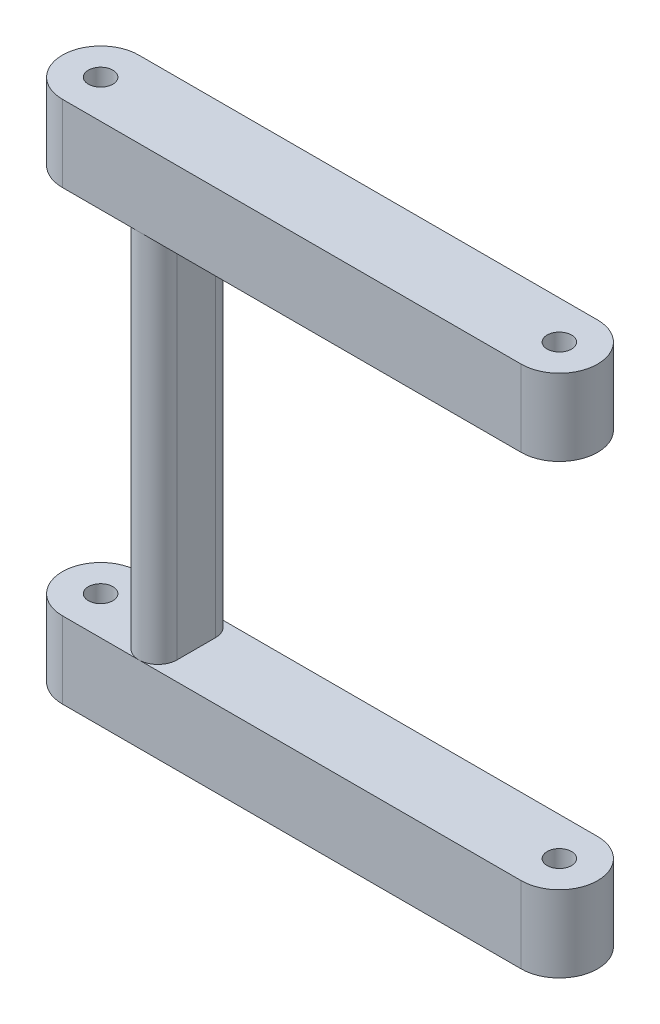
ISO-10303-21;
HEADER;
FILE_DESCRIPTION(('STEP AP214'),'2;1');
FILE_NAME('part.step','',(''),(''),'','','');
FILE_SCHEMA(('AUTOMOTIVE_DESIGN { 1 0 10303 214 1 1 1 1 }'));
ENDSEC;
DATA;
#1=APPLICATION_CONTEXT('core data for automotive mechanical design processes');
#2=APPLICATION_PROTOCOL_DEFINITION('international standard','automotive_design',2000,#1);
#3=PRODUCT_CONTEXT('',#1,'mechanical');
#4=PRODUCT('Part','Part','',(#3));
#5=PRODUCT_RELATED_PRODUCT_CATEGORY('part','',(#4));
#6=PRODUCT_DEFINITION_FORMATION('','',#4);
#7=PRODUCT_DEFINITION_CONTEXT('part definition',#1,'design');
#8=PRODUCT_DEFINITION('design','',#6,#7);
#9=PRODUCT_DEFINITION_SHAPE('','',#8);
#10=(LENGTH_UNIT() NAMED_UNIT(*) SI_UNIT(.MILLI.,.METRE.));
#11=(NAMED_UNIT(*) PLANE_ANGLE_UNIT() SI_UNIT($,.RADIAN.));
#12=(NAMED_UNIT(*) SI_UNIT($,.STERADIAN.) SOLID_ANGLE_UNIT());
#13=UNCERTAINTY_MEASURE_WITH_UNIT(LENGTH_MEASURE(1.E-05),#10,'distance_accuracy_value','');
#14=(GEOMETRIC_REPRESENTATION_CONTEXT(3) GLOBAL_UNCERTAINTY_ASSIGNED_CONTEXT((#13)) GLOBAL_UNIT_ASSIGNED_CONTEXT((#10,
#11,#12)) REPRESENTATION_CONTEXT('',''));
#15=CARTESIAN_POINT('',(0.,0.,0.));
#16=DIRECTION('',(0.,0.,1.));
#17=DIRECTION('',(1.,0.,0.));
#18=AXIS2_PLACEMENT_3D('',#15,#16,#17);
#19=CARTESIAN_POINT('',(78.1647625448029,29.725806451613,2.5));
#20=DIRECTION('',(0.,1.,0.));
#21=DIRECTION('',(0.,0.,1.));
#22=AXIS2_PLACEMENT_3D('',#19,#20,#21);
#23=CYLINDRICAL_SURFACE('',#22,2.5);
#24=CARTESIAN_POINT('',(78.1647625448029,29.725806451613,2.5));
#25=DIRECTION('',(0.,1.,0.));
#26=DIRECTION('',(0.,0.,1.));
#27=AXIS2_PLACEMENT_3D('',#24,#25,#26);
#28=CIRCLE('',#27,2.5);
#29=CARTESIAN_POINT('',(75.6647625448029,29.725806451613,2.5));
#30=VERTEX_POINT('',#29);
#31=CARTESIAN_POINT('',(78.1647625448029,29.725806451613,0.));
#32=VERTEX_POINT('',#31);
#33=EDGE_CURVE('E266',#30,#32,#28,.F.);
#34=ORIENTED_EDGE('',*,*,#33,.F.);
#35=DIRECTION('',(0.,-1.,0.));
#36=VECTOR('',#35,1.);
#37=CARTESIAN_POINT('',(75.6647625448029,29.725806451613,2.5));
#38=LINE('',#37,#36);
#39=CARTESIAN_POINT('',(75.6647625448029,78.225806451613,2.5));
#40=VERTEX_POINT('',#39);
#41=EDGE_CURVE('E261',#40,#30,#38,.T.);
#42=ORIENTED_EDGE('',*,*,#41,.F.);
#43=CARTESIAN_POINT('',(78.1647625448029,78.225806451613,2.5));
#44=DIRECTION('',(0.,-1.,0.));
#45=DIRECTION('',(1.,0.,0.));
#46=AXIS2_PLACEMENT_3D('',#43,#44,#45);
#47=CIRCLE('',#46,2.5);
#48=CARTESIAN_POINT('',(78.1647625448029,78.225806451613,0.));
#49=VERTEX_POINT('',#48);
#50=EDGE_CURVE('E13',#40,#49,#47,.T.);
#51=ORIENTED_EDGE('',*,*,#50,.T.);
#52=CARTESIAN_POINT('',(78.1647625448029,78.225806451613,2.5));
#53=DIRECTION('',(0.,-1.,0.));
#54=DIRECTION('',(1.,0.,0.));
#55=AXIS2_PLACEMENT_3D('',#52,#53,#54);
#56=CIRCLE('',#55,2.5);
#57=CARTESIAN_POINT('',(80.6647625448029,78.225806451613,2.5));
#58=VERTEX_POINT('',#57);
#59=EDGE_CURVE('E264',#58,#49,#56,.F.);
#60=ORIENTED_EDGE('',*,*,#59,.F.);
#61=DIRECTION('',(0.,1.,0.));
#62=VECTOR('',#61,1.);
#63=CARTESIAN_POINT('',(80.6647625448029,0.,2.5));
#64=LINE('',#63,#62);
#65=CARTESIAN_POINT('',(80.6647625448029,29.725806451613,2.5));
#66=VERTEX_POINT('',#65);
#67=EDGE_CURVE('E258',#66,#58,#64,.T.);
#68=ORIENTED_EDGE('',*,*,#67,.F.);
#69=CARTESIAN_POINT('',(78.1647625448029,29.725806451613,2.5));
#70=DIRECTION('',(0.,1.,0.));
#71=DIRECTION('',(0.,0.,1.));
#72=AXIS2_PLACEMENT_3D('',#69,#70,#71);
#73=CIRCLE('',#72,2.5);
#74=EDGE_CURVE('E59',#66,#32,#73,.T.);
#75=ORIENTED_EDGE('',*,*,#74,.T.);
#76=EDGE_LOOP('',(#34,#42,#51,#60,#68,#75));
#77=FACE_BOUND('',#76,.T.);
#78=ADVANCED_FACE('F50',(#77),#23,.T.);
#79=CARTESIAN_POINT('',(0.,0.,0.));
#80=DIRECTION('',(0.,0.,1.));
#81=DIRECTION('',(1.,0.,0.));
#82=AXIS2_PLACEMENT_3D('',#79,#80,#81);
#83=PLANE('',#82);
#84=DIRECTION('',(1.,0.,0.));
#85=VECTOR('',#84,1.);
#86=CARTESIAN_POINT('',(0.,29.725806451613,0.));
#87=LINE('',#86,#85);
#88=CARTESIAN_POINT('',(68.1647625448029,29.725806451613,0.));
#89=VERTEX_POINT('',#88);
#90=EDGE_CURVE('E184',#89,#32,#87,.T.);
#91=ORIENTED_EDGE('',*,*,#90,.T.);
#92=CARTESIAN_POINT('',(128.164762544803,29.725806451613,0.));
#93=VERTEX_POINT('',#92);
#94=EDGE_CURVE('E66',#32,#93,#87,.T.);
#95=ORIENTED_EDGE('',*,*,#94,.T.);
#96=DIRECTION('',(0.,1.,0.));
#97=VECTOR('',#96,1.);
#98=CARTESIAN_POINT('',(128.164762544803,19.725806451613,0.));
#99=LINE('',#98,#97);
#100=CARTESIAN_POINT('',(128.164762544803,19.725806451613,0.));
#101=VERTEX_POINT('',#100);
#102=EDGE_CURVE('E236',#93,#101,#99,.F.);
#103=ORIENTED_EDGE('',*,*,#102,.T.);
#104=DIRECTION('',(-1.,0.,0.));
#105=VECTOR('',#104,1.);
#106=CARTESIAN_POINT('',(0.,19.725806451613,0.));
#107=LINE('',#106,#105);
#108=CARTESIAN_POINT('',(68.1647625448029,19.725806451613,0.));
#109=VERTEX_POINT('',#108);
#110=EDGE_CURVE('E182',#101,#109,#107,.T.);
#111=ORIENTED_EDGE('',*,*,#110,.T.);
#112=DIRECTION('',(0.,-1.,0.));
#113=VECTOR('',#112,1.);
#114=CARTESIAN_POINT('',(68.164762544803,0.,0.));
#115=LINE('',#114,#113);
#116=EDGE_CURVE('E225',#109,#89,#115,.F.);
#117=ORIENTED_EDGE('',*,*,#116,.T.);
#118=EDGE_LOOP('',(#91,#95,#103,#111,#117));
#119=FACE_BOUND('',#118,.T.);
#120=ADVANCED_FACE('F303',(#119),#83,.F.);
#121=CARTESIAN_POINT('',(78.1647625448029,29.725806451613,7.5));
#122=DIRECTION('',(0.,1.,0.));
#123=DIRECTION('',(0.,0.,1.));
#124=AXIS2_PLACEMENT_3D('',#121,#122,#123);
#125=CYLINDRICAL_SURFACE('',#124,2.5);
#126=CARTESIAN_POINT('',(78.1647625448029,29.725806451613,7.5));
#127=DIRECTION('',(0.,1.,0.));
#128=DIRECTION('',(0.,0.,1.));
#129=AXIS2_PLACEMENT_3D('',#126,#127,#128);
#130=CIRCLE('',#129,2.5);
#131=CARTESIAN_POINT('',(80.6647625448029,29.725806451613,7.5));
#132=VERTEX_POINT('',#131);
#133=CARTESIAN_POINT('',(78.1647625448029,29.725806451613,10.));
#134=VERTEX_POINT('',#133);
#135=EDGE_CURVE('E251',#132,#134,#130,.F.);
#136=ORIENTED_EDGE('',*,*,#135,.F.);
#137=DIRECTION('',(0.,-1.,0.));
#138=VECTOR('',#137,1.);
#139=CARTESIAN_POINT('',(80.6647625448029,29.725806451613,7.5));
#140=LINE('',#139,#138);
#141=CARTESIAN_POINT('',(80.6647625448029,78.225806451613,7.5));
#142=VERTEX_POINT('',#141);
#143=EDGE_CURVE('E246',#142,#132,#140,.T.);
#144=ORIENTED_EDGE('',*,*,#143,.F.);
#145=CARTESIAN_POINT('',(78.1647625448029,78.225806451613,7.5));
#146=DIRECTION('',(0.,-1.,0.));
#147=DIRECTION('',(1.,0.,0.));
#148=AXIS2_PLACEMENT_3D('',#145,#146,#147);
#149=CIRCLE('',#148,2.5);
#150=CARTESIAN_POINT('',(78.1647625448029,78.225806451613,10.));
#151=VERTEX_POINT('',#150);
#152=EDGE_CURVE('E256',#142,#151,#149,.T.);
#153=ORIENTED_EDGE('',*,*,#152,.T.);
#154=CARTESIAN_POINT('',(78.1647625448029,78.225806451613,7.5));
#155=DIRECTION('',(0.,-1.,0.));
#156=DIRECTION('',(1.,0.,0.));
#157=AXIS2_PLACEMENT_3D('',#154,#155,#156);
#158=CIRCLE('',#157,2.5);
#159=CARTESIAN_POINT('',(75.6647625448029,78.225806451613,7.5));
#160=VERTEX_POINT('',#159);
#161=EDGE_CURVE('E249',#160,#151,#158,.F.);
#162=ORIENTED_EDGE('',*,*,#161,.F.);
#163=DIRECTION('',(0.,1.,0.));
#164=VECTOR('',#163,1.);
#165=CARTESIAN_POINT('',(75.6647625448029,0.,7.5));
#166=LINE('',#165,#164);
#167=CARTESIAN_POINT('',(75.6647625448029,29.725806451613,7.5));
#168=VERTEX_POINT('',#167);
#169=EDGE_CURVE('E243',#168,#160,#166,.T.);
#170=ORIENTED_EDGE('',*,*,#169,.F.);
#171=CARTESIAN_POINT('',(78.1647625448029,29.725806451613,7.5));
#172=DIRECTION('',(0.,1.,0.));
#173=DIRECTION('',(0.,0.,1.));
#174=AXIS2_PLACEMENT_3D('',#171,#172,#173);
#175=CIRCLE('',#174,2.5);
#176=EDGE_CURVE('E253',#168,#134,#175,.T.);
#177=ORIENTED_EDGE('',*,*,#176,.T.);
#178=EDGE_LOOP('',(#136,#144,#153,#162,#170,#177));
#179=FACE_BOUND('',#178,.T.);
#180=ADVANCED_FACE('F283',(#179),#125,.T.);
#181=CARTESIAN_POINT('',(0.,0.,10.));
#182=DIRECTION('',(0.,0.,1.));
#183=DIRECTION('',(1.,0.,0.));
#184=AXIS2_PLACEMENT_3D('',#181,#182,#183);
#185=PLANE('',#184);
#186=DIRECTION('',(1.,0.,0.));
#187=VECTOR('',#186,1.);
#188=CARTESIAN_POINT('',(0.,29.725806451613,10.));
#189=LINE('',#188,#187);
#190=CARTESIAN_POINT('',(128.164762544803,29.725806451613,10.));
#191=VERTEX_POINT('',#190);
#192=EDGE_CURVE('E190',#134,#191,#189,.T.);
#193=ORIENTED_EDGE('',*,*,#192,.F.);
#194=CARTESIAN_POINT('',(68.1647625448029,29.725806451613,10.));
#195=VERTEX_POINT('',#194);
#196=EDGE_CURVE('E186',#195,#134,#189,.T.);
#197=ORIENTED_EDGE('',*,*,#196,.F.);
#198=DIRECTION('',(0.,1.,0.));
#199=VECTOR('',#198,1.);
#200=CARTESIAN_POINT('',(68.1647625448029,29.725806451613,10.));
#201=LINE('',#200,#199);
#202=CARTESIAN_POINT('',(68.1647625448029,19.725806451613,10.));
#203=VERTEX_POINT('',#202);
#204=EDGE_CURVE('E222',#195,#203,#201,.F.);
#205=ORIENTED_EDGE('',*,*,#204,.T.);
#206=DIRECTION('',(-1.,0.,0.));
#207=VECTOR('',#206,1.);
#208=CARTESIAN_POINT('',(0.,19.725806451613,10.));
#209=LINE('',#208,#207);
#210=CARTESIAN_POINT('',(128.164762544803,19.725806451613,10.));
#211=VERTEX_POINT('',#210);
#212=EDGE_CURVE('E188',#211,#203,#209,.T.);
#213=ORIENTED_EDGE('',*,*,#212,.F.);
#214=DIRECTION('',(0.,-1.,0.));
#215=VECTOR('',#214,1.);
#216=CARTESIAN_POINT('',(128.164762544803,0.,10.));
#217=LINE('',#216,#215);
#218=EDGE_CURVE('E233',#211,#191,#217,.F.);
#219=ORIENTED_EDGE('',*,*,#218,.T.);
#220=EDGE_LOOP('',(#193,#197,#205,#213,#219));
#221=FACE_BOUND('',#220,.T.);
#222=ADVANCED_FACE('F313',(#221),#185,.T.);
#223=CARTESIAN_POINT('',(128.164762544803,19.725806451613,5.));
#224=DIRECTION('',(0.,-1.,0.));
#225=DIRECTION('',(0.,0.,-1.));
#226=AXIS2_PLACEMENT_3D('',#223,#224,#225);
#227=CYLINDRICAL_SURFACE('',#226,5.);
#228=ORIENTED_EDGE('',*,*,#218,.F.);
#229=CARTESIAN_POINT('',(128.164762544803,19.725806451613,5.));
#230=DIRECTION('',(0.,-1.,0.));
#231=DIRECTION('',(0.,0.,-1.));
#232=AXIS2_PLACEMENT_3D('',#229,#230,#231);
#233=CIRCLE('',#232,5.);
#234=EDGE_CURVE('E239',#101,#211,#233,.T.);
#235=ORIENTED_EDGE('',*,*,#234,.F.);
#236=ORIENTED_EDGE('',*,*,#102,.F.);
#237=CARTESIAN_POINT('',(128.164762544803,29.725806451613,5.));
#238=DIRECTION('',(0.,1.,0.));
#239=DIRECTION('',(0.,0.,1.));
#240=AXIS2_PLACEMENT_3D('',#237,#238,#239);
#241=CIRCLE('',#240,5.);
#242=EDGE_CURVE('E241',#191,#93,#241,.T.);
#243=ORIENTED_EDGE('',*,*,#242,.F.);
#244=EDGE_LOOP('',(#228,#235,#236,#243));
#245=FACE_BOUND('',#244,.T.);
#246=ADVANCED_FACE('F344',(#245),#227,.T.);
#247=CARTESIAN_POINT('',(68.1647625448029,29.725806451613,5.));
#248=DIRECTION('',(0.,-1.,0.));
#249=DIRECTION('',(1.,0.,0.));
#250=AXIS2_PLACEMENT_3D('',#247,#248,#249);
#251=CYLINDRICAL_SURFACE('',#250,5.);
#252=ORIENTED_EDGE('',*,*,#204,.F.);
#253=CARTESIAN_POINT('',(68.1647625448029,29.725806451613,5.));
#254=DIRECTION('',(0.,1.,0.));
#255=DIRECTION('',(0.,0.,1.));
#256=AXIS2_PLACEMENT_3D('',#253,#254,#255);
#257=CIRCLE('',#256,5.);
#258=EDGE_CURVE('E228',#89,#195,#257,.T.);
#259=ORIENTED_EDGE('',*,*,#258,.F.);
#260=ORIENTED_EDGE('',*,*,#116,.F.);
#261=CARTESIAN_POINT('',(68.1647625448029,19.725806451613,5.));
#262=DIRECTION('',(0.,-1.,0.));
#263=DIRECTION('',(0.,0.,-1.));
#264=AXIS2_PLACEMENT_3D('',#261,#262,#263);
#265=CIRCLE('',#264,5.);
#266=EDGE_CURVE('E230',#203,#109,#265,.T.);
#267=ORIENTED_EDGE('',*,*,#266,.F.);
#268=EDGE_LOOP('',(#252,#259,#260,#267));
#269=FACE_BOUND('',#268,.T.);
#270=ADVANCED_FACE('F340',(#269),#251,.T.);
#271=CARTESIAN_POINT('',(68.1647625448029,78.225806451613,5.));
#272=DIRECTION('',(0.,-1.,0.));
#273=DIRECTION('',(1.,0.,0.));
#274=AXIS2_PLACEMENT_3D('',#271,#272,#273);
#275=CYLINDRICAL_SURFACE('',#274,5.);
#276=DIRECTION('',(0.,-1.,0.));
#277=VECTOR('',#276,1.);
#278=CARTESIAN_POINT('',(68.1647625448028,0.,0.));
#279=LINE('',#278,#277);
#280=CARTESIAN_POINT('',(68.1647625448029,78.225806451613,0.));
#281=VERTEX_POINT('',#280);
#282=CARTESIAN_POINT('',(68.1647625448029,88.225806451613,0.));
#283=VERTEX_POINT('',#282);
#284=EDGE_CURVE('E213',#281,#283,#279,.F.);
#285=ORIENTED_EDGE('',*,*,#284,.F.);
#286=CARTESIAN_POINT('',(68.1647625448029,78.225806451613,5.));
#287=DIRECTION('',(0.,-1.,0.));
#288=DIRECTION('',(1.,0.,0.));
#289=AXIS2_PLACEMENT_3D('',#286,#287,#288);
#290=CIRCLE('',#289,5.);
#291=CARTESIAN_POINT('',(68.1647625448029,78.225806451613,10.));
#292=VERTEX_POINT('',#291);
#293=EDGE_CURVE('E218',#292,#281,#290,.T.);
#294=ORIENTED_EDGE('',*,*,#293,.F.);
#295=DIRECTION('',(0.,1.,0.));
#296=VECTOR('',#295,1.);
#297=CARTESIAN_POINT('',(68.1647625448029,78.225806451613,10.));
#298=LINE('',#297,#296);
#299=CARTESIAN_POINT('',(68.1647625448029,88.225806451613,10.));
#300=VERTEX_POINT('',#299);
#301=EDGE_CURVE('E216',#300,#292,#298,.F.);
#302=ORIENTED_EDGE('',*,*,#301,.F.);
#303=CARTESIAN_POINT('',(68.1647625448029,88.225806451613,5.));
#304=DIRECTION('',(0.,1.,0.));
#305=DIRECTION('',(0.,0.,1.));
#306=AXIS2_PLACEMENT_3D('',#303,#304,#305);
#307=CIRCLE('',#306,5.);
#308=EDGE_CURVE('E220',#283,#300,#307,.T.);
#309=ORIENTED_EDGE('',*,*,#308,.F.);
#310=EDGE_LOOP('',(#285,#294,#302,#309));
#311=FACE_BOUND('',#310,.T.);
#312=ADVANCED_FACE('F351',(#311),#275,.T.);
#313=CARTESIAN_POINT('',(128.164762544803,78.225806451613,5.));
#314=DIRECTION('',(0.,-1.,0.));
#315=DIRECTION('',(1.,0.,0.));
#316=AXIS2_PLACEMENT_3D('',#313,#314,#315);
#317=CYLINDRICAL_SURFACE('',#316,5.);
#318=DIRECTION('',(0.,-1.,0.));
#319=VECTOR('',#318,1.);
#320=CARTESIAN_POINT('',(128.164762544803,3.55728675807142E-13,10.));
#321=LINE('',#320,#319);
#322=CARTESIAN_POINT('',(128.164762544803,78.225806451613,10.));
#323=VERTEX_POINT('',#322);
#324=CARTESIAN_POINT('',(128.164762544803,88.225806451613,10.));
#325=VERTEX_POINT('',#324);
#326=EDGE_CURVE('E167',#323,#325,#321,.F.);
#327=ORIENTED_EDGE('',*,*,#326,.F.);
#328=CARTESIAN_POINT('',(128.164762544803,78.225806451613,5.));
#329=DIRECTION('',(0.,-1.,0.));
#330=DIRECTION('',(1.,0.,0.));
#331=AXIS2_PLACEMENT_3D('',#328,#329,#330);
#332=CIRCLE('',#331,5.);
#333=CARTESIAN_POINT('',(128.164762544803,78.225806451613,0.));
#334=VERTEX_POINT('',#333);
#335=EDGE_CURVE('E151',#334,#323,#332,.T.);
#336=ORIENTED_EDGE('',*,*,#335,.F.);
#337=DIRECTION('',(0.,1.,0.));
#338=VECTOR('',#337,1.);
#339=CARTESIAN_POINT('',(128.164762544803,78.225806451613,0.));
#340=LINE('',#339,#338);
#341=CARTESIAN_POINT('',(128.164762544803,88.225806451613,0.));
#342=VERTEX_POINT('',#341);
#343=EDGE_CURVE('E163',#342,#334,#340,.F.);
#344=ORIENTED_EDGE('',*,*,#343,.F.);
#345=CARTESIAN_POINT('',(128.164762544803,88.225806451613,5.));
#346=DIRECTION('',(0.,1.,0.));
#347=DIRECTION('',(0.,0.,1.));
#348=AXIS2_PLACEMENT_3D('',#345,#346,#347);
#349=CIRCLE('',#348,5.);
#350=EDGE_CURVE('E162',#325,#342,#349,.T.);
#351=ORIENTED_EDGE('',*,*,#350,.F.);
#352=EDGE_LOOP('',(#327,#336,#344,#351));
#353=FACE_BOUND('',#352,.T.);
#354=ADVANCED_FACE('F168',(#353),#317,.T.);
#355=CARTESIAN_POINT('',(0.,78.2258064516129,10.));
#356=DIRECTION('',(0.,-1.,0.));
#357=DIRECTION('',(1.,0.,0.));
#358=AXIS2_PLACEMENT_3D('',#355,#356,#357);
#359=PLANE('',#358);
#360=CARTESIAN_POINT('',(128.164762544803,78.225806451613,5.));
#361=DIRECTION('',(0.,-1.,0.));
#362=DIRECTION('',(1.,0.,0.));
#363=AXIS2_PLACEMENT_3D('',#360,#361,#362);
#364=CIRCLE('',#363,1.60000000000002);
#365=CARTESIAN_POINT('',(129.764762544803,78.225806451613,5.));
#366=VERTEX_POINT('',#365);
#367=EDGE_CURVE('E445',#366,#366,#364,.T.);
#368=ORIENTED_EDGE('',*,*,#367,.F.);
#369=EDGE_LOOP('',(#368));
#370=FACE_BOUND('',#369,.T.);
#371=DIRECTION('',(-1.,0.,0.));
#372=VECTOR('',#371,1.);
#373=CARTESIAN_POINT('',(0.,78.2258064516129,0.));
#374=LINE('',#373,#372);
#375=EDGE_CURVE('E158',#334,#49,#374,.T.);
#376=ORIENTED_EDGE('',*,*,#375,.F.);
#377=ORIENTED_EDGE('',*,*,#335,.T.);
#378=DIRECTION('',(-1.,0.,0.));
#379=VECTOR('',#378,1.);
#380=CARTESIAN_POINT('',(0.,78.2258064516129,10.));
#381=LINE('',#380,#379);
#382=EDGE_CURVE('E155',#323,#151,#381,.T.);
#383=ORIENTED_EDGE('',*,*,#382,.T.);
#384=ORIENTED_EDGE('',*,*,#152,.F.);
#385=DIRECTION('',(0.,0.,-1.));
#386=VECTOR('',#385,1.);
#387=CARTESIAN_POINT('',(80.6647625448029,78.225806451613,10.));
#388=LINE('',#387,#386);
#389=EDGE_CURVE('E196',#142,#58,#388,.T.);
#390=ORIENTED_EDGE('',*,*,#389,.T.);
#391=ORIENTED_EDGE('',*,*,#59,.T.);
#392=EDGE_LOOP('',(#376,#377,#383,#384,#390,#391));
#393=FACE_BOUND('',#392,.T.);
#394=ADVANCED_FACE('F153',(#370,#393),#359,.T.);
#395=CARTESIAN_POINT('',(0.,88.225806451613,10.));
#396=DIRECTION('',(0.,1.,0.));
#397=DIRECTION('',(0.,0.,1.));
#398=AXIS2_PLACEMENT_3D('',#395,#396,#397);
#399=PLANE('',#398);
#400=CARTESIAN_POINT('',(128.164762544803,88.225806451613,5.));
#401=DIRECTION('',(0.,1.,0.));
#402=DIRECTION('',(0.,0.,1.));
#403=AXIS2_PLACEMENT_3D('',#400,#401,#402);
#404=CIRCLE('',#403,1.60000000000002);
#405=CARTESIAN_POINT('',(128.164762544803,88.225806451613,6.60000000000002));
#406=VERTEX_POINT('',#405);
#407=EDGE_CURVE('E448',#406,#406,#404,.T.);
#408=ORIENTED_EDGE('',*,*,#407,.F.);
#409=EDGE_LOOP('',(#408));
#410=FACE_BOUND('',#409,.T.);
#411=CARTESIAN_POINT('',(68.1647625448029,88.225806451613,5.));
#412=DIRECTION('',(0.,1.,0.));
#413=DIRECTION('',(0.,0.,1.));
#414=AXIS2_PLACEMENT_3D('',#411,#412,#413);
#415=CIRCLE('',#414,1.60000000000001);
#416=CARTESIAN_POINT('',(68.1647625448029,88.225806451613,6.6));
#417=VERTEX_POINT('',#416);
#418=EDGE_CURVE('E455',#417,#417,#415,.T.);
#419=ORIENTED_EDGE('',*,*,#418,.F.);
#420=EDGE_LOOP('',(#419));
#421=FACE_BOUND('',#420,.T.);
#422=DIRECTION('',(1.,0.,0.));
#423=VECTOR('',#422,1.);
#424=CARTESIAN_POINT('',(0.,88.225806451613,0.));
#425=LINE('',#424,#423);
#426=EDGE_CURVE('E326',#283,#342,#425,.T.);
#427=ORIENTED_EDGE('',*,*,#426,.F.);
#428=ORIENTED_EDGE('',*,*,#308,.T.);
#429=DIRECTION('',(1.,0.,0.));
#430=VECTOR('',#429,1.);
#431=CARTESIAN_POINT('',(0.,88.225806451613,10.));
#432=LINE('',#431,#430);
#433=EDGE_CURVE('E179',#300,#325,#432,.T.);
#434=ORIENTED_EDGE('',*,*,#433,.T.);
#435=ORIENTED_EDGE('',*,*,#350,.T.);
#436=EDGE_LOOP('',(#427,#428,#434,#435));
#437=FACE_BOUND('',#436,.T.);
#438=ADVANCED_FACE('F376',(#410,#421,#437),#399,.T.);
#439=CARTESIAN_POINT('',(68.1647625448029,78.225806451613,5.));
#440=DIRECTION('',(0.,-1.,0.));
#441=DIRECTION('',(1.,0.,0.));
#442=AXIS2_PLACEMENT_3D('',#439,#440,#441);
#443=CIRCLE('',#442,1.60000000000001);
#444=CARTESIAN_POINT('',(69.7647625448029,78.225806451613,5.));
#445=VERTEX_POINT('',#444);
#446=EDGE_CURVE('E327',#445,#445,#443,.T.);
#447=ORIENTED_EDGE('',*,*,#446,.F.);
#448=EDGE_LOOP('',(#447));
#449=FACE_BOUND('',#448,.T.);
#450=EDGE_CURVE('E177',#151,#292,#381,.T.);
#451=ORIENTED_EDGE('',*,*,#450,.T.);
#452=ORIENTED_EDGE('',*,*,#293,.T.);
#453=EDGE_CURVE('E74',#49,#281,#374,.T.);
#454=ORIENTED_EDGE('',*,*,#453,.F.);
#455=ORIENTED_EDGE('',*,*,#50,.F.);
#456=DIRECTION('',(0.,0.,-1.));
#457=VECTOR('',#456,1.);
#458=CARTESIAN_POINT('',(75.6647625448029,78.225806451613,10.));
#459=LINE('',#458,#457);
#460=EDGE_CURVE('E172',#160,#40,#459,.T.);
#461=ORIENTED_EDGE('',*,*,#460,.F.);
#462=ORIENTED_EDGE('',*,*,#161,.T.);
#463=EDGE_LOOP('',(#451,#452,#454,#455,#461,#462));
#464=FACE_BOUND('',#463,.T.);
#465=ADVANCED_FACE('F281',(#449,#464),#359,.T.);
#466=CARTESIAN_POINT('',(75.6647625448029,0.,10.));
#467=DIRECTION('',(-1.,0.,0.));
#468=DIRECTION('',(0.,0.,1.));
#469=AXIS2_PLACEMENT_3D('',#466,#467,#468);
#470=PLANE('',#469);
#471=ORIENTED_EDGE('',*,*,#460,.T.);
#472=ORIENTED_EDGE('',*,*,#41,.T.);
#473=DIRECTION('',(0.,0.,-1.));
#474=VECTOR('',#473,1.);
#475=CARTESIAN_POINT('',(75.6647625448029,29.725806451613,10.));
#476=LINE('',#475,#474);
#477=EDGE_CURVE('E203',#168,#30,#476,.T.);
#478=ORIENTED_EDGE('',*,*,#477,.F.);
#479=ORIENTED_EDGE('',*,*,#169,.T.);
#480=EDGE_LOOP('',(#471,#472,#478,#479));
#481=FACE_BOUND('',#480,.T.);
#482=ADVANCED_FACE('F279',(#481),#470,.T.);
#483=CARTESIAN_POINT('',(0.,29.725806451613,10.));
#484=DIRECTION('',(0.,1.,0.));
#485=DIRECTION('',(0.,0.,1.));
#486=AXIS2_PLACEMENT_3D('',#483,#484,#485);
#487=PLANE('',#486);
#488=CARTESIAN_POINT('',(68.1647625448029,29.725806451613,5.));
#489=DIRECTION('',(0.,1.,0.));
#490=DIRECTION('',(0.,0.,1.));
#491=AXIS2_PLACEMENT_3D('',#488,#489,#490);
#492=CIRCLE('',#491,1.60000000000001);
#493=CARTESIAN_POINT('',(68.1647625448029,29.725806451613,6.6));
#494=VERTEX_POINT('',#493);
#495=EDGE_CURVE('E331',#494,#494,#492,.T.);
#496=ORIENTED_EDGE('',*,*,#495,.F.);
#497=EDGE_LOOP('',(#496));
#498=FACE_BOUND('',#497,.T.);
#499=ORIENTED_EDGE('',*,*,#90,.F.);
#500=ORIENTED_EDGE('',*,*,#258,.T.);
#501=ORIENTED_EDGE('',*,*,#196,.T.);
#502=ORIENTED_EDGE('',*,*,#176,.F.);
#503=ORIENTED_EDGE('',*,*,#477,.T.);
#504=ORIENTED_EDGE('',*,*,#33,.T.);
#505=EDGE_LOOP('',(#499,#500,#501,#502,#503,#504));
#506=FACE_BOUND('',#505,.T.);
#507=ADVANCED_FACE('F275',(#498,#506),#487,.T.);
#508=CARTESIAN_POINT('',(0.,19.725806451613,10.));
#509=DIRECTION('',(0.,-1.,0.));
#510=DIRECTION('',(0.,0.,-1.));
#511=AXIS2_PLACEMENT_3D('',#508,#509,#510);
#512=PLANE('',#511);
#513=CARTESIAN_POINT('',(128.164762544803,19.725806451613,5.));
#514=DIRECTION('',(0.,1.,0.));
#515=DIRECTION('',(0.,0.,1.));
#516=AXIS2_PLACEMENT_3D('',#513,#514,#515);
#517=CIRCLE('',#516,1.60000000000002);
#518=CARTESIAN_POINT('',(128.164762544803,19.725806451613,6.60000000000002));
#519=VERTEX_POINT('',#518);
#520=EDGE_CURVE('E449',#519,#519,#517,.T.);
#521=ORIENTED_EDGE('',*,*,#520,.T.);
#522=EDGE_LOOP('',(#521));
#523=FACE_BOUND('',#522,.T.);
#524=CARTESIAN_POINT('',(68.1647625448029,19.725806451613,5.));
#525=DIRECTION('',(0.,1.,0.));
#526=DIRECTION('',(0.,0.,1.));
#527=AXIS2_PLACEMENT_3D('',#524,#525,#526);
#528=CIRCLE('',#527,1.60000000000001);
#529=CARTESIAN_POINT('',(68.1647625448029,19.725806451613,6.6));
#530=VERTEX_POINT('',#529);
#531=EDGE_CURVE('E450',#530,#530,#528,.T.);
#532=ORIENTED_EDGE('',*,*,#531,.T.);
#533=EDGE_LOOP('',(#532));
#534=FACE_BOUND('',#533,.T.);
#535=ORIENTED_EDGE('',*,*,#110,.F.);
#536=ORIENTED_EDGE('',*,*,#234,.T.);
#537=ORIENTED_EDGE('',*,*,#212,.T.);
#538=ORIENTED_EDGE('',*,*,#266,.T.);
#539=EDGE_LOOP('',(#535,#536,#537,#538));
#540=FACE_BOUND('',#539,.T.);
#541=ADVANCED_FACE('F289',(#523,#534,#540),#512,.T.);
#542=CARTESIAN_POINT('',(128.164762544803,29.725806451613,5.));
#543=DIRECTION('',(0.,1.,0.));
#544=DIRECTION('',(0.,0.,1.));
#545=AXIS2_PLACEMENT_3D('',#542,#543,#544);
#546=CIRCLE('',#545,1.60000000000002);
#547=CARTESIAN_POINT('',(128.164762544803,29.725806451613,6.60000000000002));
#548=VERTEX_POINT('',#547);
#549=EDGE_CURVE('E54',#548,#548,#546,.T.);
#550=ORIENTED_EDGE('',*,*,#549,.F.);
#551=EDGE_LOOP('',(#550));
#552=FACE_BOUND('',#551,.T.);
#553=ORIENTED_EDGE('',*,*,#192,.T.);
#554=ORIENTED_EDGE('',*,*,#242,.T.);
#555=ORIENTED_EDGE('',*,*,#94,.F.);
#556=ORIENTED_EDGE('',*,*,#74,.F.);
#557=DIRECTION('',(0.,0.,-1.));
#558=VECTOR('',#557,1.);
#559=CARTESIAN_POINT('',(80.6647625448029,29.725806451613,10.));
#560=LINE('',#559,#558);
#561=EDGE_CURVE('E199',#132,#66,#560,.T.);
#562=ORIENTED_EDGE('',*,*,#561,.F.);
#563=ORIENTED_EDGE('',*,*,#135,.T.);
#564=EDGE_LOOP('',(#553,#554,#555,#556,#562,#563));
#565=FACE_BOUND('',#564,.T.);
#566=ADVANCED_FACE('F287',(#552,#565),#487,.T.);
#567=CARTESIAN_POINT('',(80.6647625448029,0.,10.));
#568=DIRECTION('',(-1.,0.,0.));
#569=DIRECTION('',(0.,0.,1.));
#570=AXIS2_PLACEMENT_3D('',#567,#568,#569);
#571=PLANE('',#570);
#572=ORIENTED_EDGE('',*,*,#561,.T.);
#573=ORIENTED_EDGE('',*,*,#67,.T.);
#574=ORIENTED_EDGE('',*,*,#389,.F.);
#575=ORIENTED_EDGE('',*,*,#143,.T.);
#576=EDGE_LOOP('',(#572,#573,#574,#575));
#577=FACE_BOUND('',#576,.T.);
#578=ADVANCED_FACE('F286',(#577),#571,.F.);
#579=ORIENTED_EDGE('',*,*,#450,.F.);
#580=ORIENTED_EDGE('',*,*,#382,.F.);
#581=ORIENTED_EDGE('',*,*,#326,.T.);
#582=ORIENTED_EDGE('',*,*,#433,.F.);
#583=ORIENTED_EDGE('',*,*,#301,.T.);
#584=EDGE_LOOP('',(#579,#580,#581,#582,#583));
#585=FACE_BOUND('',#584,.T.);
#586=ADVANCED_FACE('F174',(#585),#185,.T.);
#587=ORIENTED_EDGE('',*,*,#375,.T.);
#588=ORIENTED_EDGE('',*,*,#453,.T.);
#589=ORIENTED_EDGE('',*,*,#284,.T.);
#590=ORIENTED_EDGE('',*,*,#426,.T.);
#591=ORIENTED_EDGE('',*,*,#343,.T.);
#592=EDGE_LOOP('',(#587,#588,#589,#590,#591));
#593=FACE_BOUND('',#592,.T.);
#594=ADVANCED_FACE('F309',(#593),#83,.F.);
#595=CARTESIAN_POINT('',(128.164762544803,19.725806451613,5.));
#596=DIRECTION('',(0.,1.,0.));
#597=DIRECTION('',(0.,0.,1.));
#598=AXIS2_PLACEMENT_3D('',#595,#596,#597);
#599=CYLINDRICAL_SURFACE('',#598,1.60000000000002);
#600=ORIENTED_EDGE('',*,*,#549,.T.);
#601=EDGE_LOOP('',(#600));
#602=FACE_BOUND('',#601,.T.);
#603=ORIENTED_EDGE('',*,*,#520,.F.);
#604=EDGE_LOOP('',(#603));
#605=FACE_BOUND('',#604,.T.);
#606=ADVANCED_FACE('F316',(#602,#605),#599,.F.);
#607=CARTESIAN_POINT('',(68.1647625448029,19.725806451613,5.));
#608=DIRECTION('',(0.,1.,0.));
#609=DIRECTION('',(0.,0.,1.));
#610=AXIS2_PLACEMENT_3D('',#607,#608,#609);
#611=CYLINDRICAL_SURFACE('',#610,1.60000000000001);
#612=ORIENTED_EDGE('',*,*,#495,.T.);
#613=EDGE_LOOP('',(#612));
#614=FACE_BOUND('',#613,.T.);
#615=ORIENTED_EDGE('',*,*,#531,.F.);
#616=EDGE_LOOP('',(#615));
#617=FACE_BOUND('',#616,.T.);
#618=ADVANCED_FACE('F322',(#614,#617),#611,.F.);
#619=ORIENTED_EDGE('',*,*,#446,.T.);
#620=EDGE_LOOP('',(#619));
#621=FACE_BOUND('',#620,.T.);
#622=ORIENTED_EDGE('',*,*,#418,.T.);
#623=EDGE_LOOP('',(#622));
#624=FACE_BOUND('',#623,.T.);
#625=ADVANCED_FACE('F421',(#621,#624),#611,.F.);
#626=ORIENTED_EDGE('',*,*,#367,.T.);
#627=EDGE_LOOP('',(#626));
#628=FACE_BOUND('',#627,.T.);
#629=ORIENTED_EDGE('',*,*,#407,.T.);
#630=EDGE_LOOP('',(#629));
#631=FACE_BOUND('',#630,.T.);
#632=ADVANCED_FACE('F325',(#628,#631),#599,.F.);
#633=CLOSED_SHELL('',(#78,#120,#180,#222,#246,#270,#312,#354,#394,#438,#465,#482,#507,#541,#566,
#578,#586,#594,#606,#618,#625,#632));
#634=MANIFOLD_SOLID_BREP('B2',#633);
#635=ADVANCED_BREP_SHAPE_REPRESENTATION('',(#18,#634),#14);
#636=SHAPE_DEFINITION_REPRESENTATION(#9,#635);
ENDSEC;
END-ISO-10303-21;
